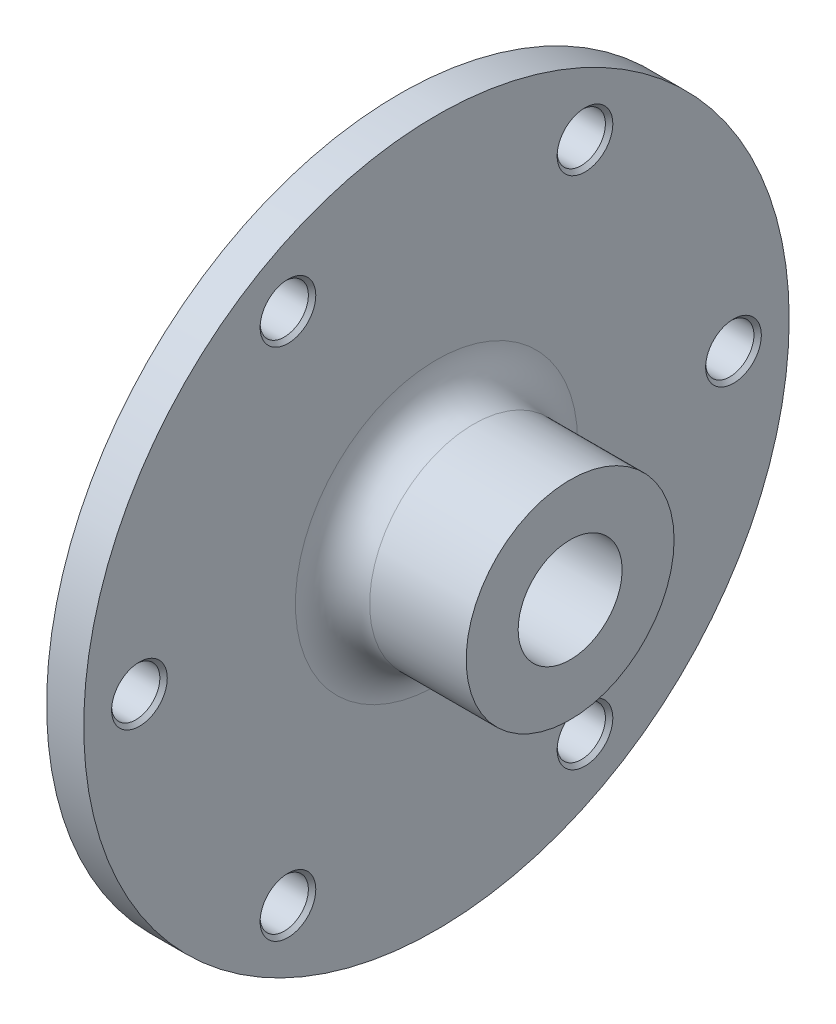
ISO-10303-21;
HEADER;
FILE_DESCRIPTION(('STEP AP214'),'2;1');
FILE_NAME('part.step','',(''),(''),'','','');
FILE_SCHEMA(('AUTOMOTIVE_DESIGN { 1 0 10303 214 1 1 1 1 }'));
ENDSEC;
DATA;
#1=APPLICATION_CONTEXT('core data for automotive mechanical design processes');
#2=APPLICATION_PROTOCOL_DEFINITION('international standard','automotive_design',2000,#1);
#3=PRODUCT_CONTEXT('',#1,'mechanical');
#4=PRODUCT('Part','Part','',(#3));
#5=PRODUCT_RELATED_PRODUCT_CATEGORY('part','',(#4));
#6=PRODUCT_DEFINITION_FORMATION('','',#4);
#7=PRODUCT_DEFINITION_CONTEXT('part definition',#1,'design');
#8=PRODUCT_DEFINITION('design','',#6,#7);
#9=PRODUCT_DEFINITION_SHAPE('','',#8);
#10=(LENGTH_UNIT() NAMED_UNIT(*) SI_UNIT(.MILLI.,.METRE.));
#11=(NAMED_UNIT(*) PLANE_ANGLE_UNIT() SI_UNIT($,.RADIAN.));
#12=(NAMED_UNIT(*) SI_UNIT($,.STERADIAN.) SOLID_ANGLE_UNIT());
#13=UNCERTAINTY_MEASURE_WITH_UNIT(LENGTH_MEASURE(1.E-05),#10,'distance_accuracy_value','');
#14=(GEOMETRIC_REPRESENTATION_CONTEXT(3) GLOBAL_UNCERTAINTY_ASSIGNED_CONTEXT((#13)) GLOBAL_UNIT_ASSIGNED_CONTEXT((#10,
#11,#12)) REPRESENTATION_CONTEXT('',''));
#15=CARTESIAN_POINT('',(0.,0.,0.));
#16=DIRECTION('',(0.,0.,1.));
#17=DIRECTION('',(1.,0.,0.));
#18=AXIS2_PLACEMENT_3D('',#15,#16,#17);
#19=CARTESIAN_POINT('',(0.,14.,0.));
#20=DIRECTION('',(1.,0.,0.));
#21=DIRECTION('',(0.,0.,-1.));
#22=AXIS2_PLACEMENT_3D('',#19,#20,#21);
#23=PLANE('',#22);
#24=CARTESIAN_POINT('',(0.,0.,0.));
#25=DIRECTION('',(-1.,0.,0.));
#26=DIRECTION('',(0.,0.,1.));
#27=AXIS2_PLACEMENT_3D('',#24,#25,#26);
#28=CIRCLE('',#27,6.99999999999999);
#29=CARTESIAN_POINT('',(0.,0.,6.99999999999999));
#30=VERTEX_POINT('',#29);
#31=EDGE_CURVE('E109',#30,#30,#28,.T.);
#32=ORIENTED_EDGE('',*,*,#31,.T.);
#33=EDGE_LOOP('',(#32));
#34=FACE_BOUND('',#33,.T.);
#35=CARTESIAN_POINT('',(0.,0.,0.));
#36=DIRECTION('',(1.,0.,0.));
#37=DIRECTION('',(0.,0.,-1.));
#38=AXIS2_PLACEMENT_3D('',#35,#36,#37);
#39=CIRCLE('',#38,14.);
#40=CARTESIAN_POINT('',(0.,0.,-14.));
#41=VERTEX_POINT('',#40);
#42=EDGE_CURVE('E112',#41,#41,#39,.T.);
#43=ORIENTED_EDGE('',*,*,#42,.T.);
#44=EDGE_LOOP('',(#43));
#45=FACE_BOUND('',#44,.T.);
#46=ADVANCED_FACE('F37',(#34,#45),#23,.T.);
#47=CARTESIAN_POINT('',(-28.,0.,0.));
#48=DIRECTION('',(-1.,0.,0.));
#49=DIRECTION('',(0.,0.,1.));
#50=AXIS2_PLACEMENT_3D('',#47,#48,#49);
#51=PLANE('',#50);
#52=CARTESIAN_POINT('',(-28.,0.,0.));
#53=DIRECTION('',(-1.,0.,0.));
#54=DIRECTION('',(0.,0.,1.));
#55=AXIS2_PLACEMENT_3D('',#52,#53,#54);
#56=CIRCLE('',#55,13.);
#57=CARTESIAN_POINT('',(-28.,0.,13.));
#58=VERTEX_POINT('',#57);
#59=EDGE_CURVE('E57',#58,#58,#56,.T.);
#60=ORIENTED_EDGE('',*,*,#59,.F.);
#61=EDGE_LOOP('',(#60));
#62=FACE_BOUND('',#61,.T.);
#63=CARTESIAN_POINT('',(-28.,0.,0.));
#64=DIRECTION('',(1.,0.,0.));
#65=DIRECTION('',(0.,0.,-1.));
#66=AXIS2_PLACEMENT_3D('',#63,#64,#65);
#67=CIRCLE('',#66,35.);
#68=CARTESIAN_POINT('',(-28.,0.,-35.));
#69=VERTEX_POINT('',#68);
#70=EDGE_CURVE('E50',#69,#69,#67,.T.);
#71=ORIENTED_EDGE('',*,*,#70,.F.);
#72=EDGE_LOOP('',(#71));
#73=FACE_BOUND('',#72,.T.);
#74=ADVANCED_FACE('F129',(#62,#73),#51,.T.);
#75=CARTESIAN_POINT('',(0.,0.,0.));
#76=DIRECTION('',(1.,0.,0.));
#77=DIRECTION('',(0.,0.,-1.));
#78=AXIS2_PLACEMENT_3D('',#75,#76,#77);
#79=CYLINDRICAL_SURFACE('',#78,35.);
#80=ORIENTED_EDGE('',*,*,#70,.T.);
#81=EDGE_LOOP('',(#80));
#82=FACE_BOUND('',#81,.T.);
#83=CARTESIAN_POINT('',(-23.,0.,0.));
#84=DIRECTION('',(1.,0.,0.));
#85=DIRECTION('',(0.,0.,-1.));
#86=AXIS2_PLACEMENT_3D('',#83,#84,#85);
#87=CIRCLE('',#86,35.);
#88=CARTESIAN_POINT('',(-23.,0.,-35.));
#89=VERTEX_POINT('',#88);
#90=EDGE_CURVE('E121',#89,#89,#87,.T.);
#91=ORIENTED_EDGE('',*,*,#90,.F.);
#92=EDGE_LOOP('',(#91));
#93=FACE_BOUND('',#92,.T.);
#94=ADVANCED_FACE('F126',(#82,#93),#79,.T.);
#95=CARTESIAN_POINT('',(-23.,35.,0.));
#96=DIRECTION('',(-1.,0.,0.));
#97=DIRECTION('',(0.,0.,1.));
#98=AXIS2_PLACEMENT_3D('',#95,#96,#97);
#99=PLANE('',#98);
#100=CARTESIAN_POINT('',(-23.,34.6410161513773,20.0000000000004));
#101=DIRECTION('',(-1.,0.,0.));
#102=DIRECTION('',(0.,0.,1.));
#103=AXIS2_PLACEMENT_3D('',#100,#101,#102);
#104=CIRCLE('',#103,3.25);
#105=CARTESIAN_POINT('',(-23.,34.6410161513773,23.2500000000004));
#106=VERTEX_POINT('',#105);
#107=EDGE_CURVE('E41',#106,#106,#104,.T.);
#108=ORIENTED_EDGE('',*,*,#107,.F.);
#109=EDGE_LOOP('',(#108));
#110=FACE_BOUND('',#109,.T.);
#111=CARTESIAN_POINT('',(-23.,34.6410161513777,-19.9999999999997));
#112=DIRECTION('',(-1.,0.,0.));
#113=DIRECTION('',(0.,0.,1.));
#114=AXIS2_PLACEMENT_3D('',#111,#112,#113);
#115=CIRCLE('',#114,3.25);
#116=CARTESIAN_POINT('',(-23.,34.6410161513777,-16.7499999999997));
#117=VERTEX_POINT('',#116);
#118=EDGE_CURVE('E73',#117,#117,#115,.T.);
#119=ORIENTED_EDGE('',*,*,#118,.F.);
#120=EDGE_LOOP('',(#119));
#121=FACE_BOUND('',#120,.T.);
#122=CARTESIAN_POINT('',(-23.,0.,-40.));
#123=DIRECTION('',(-1.,0.,0.));
#124=DIRECTION('',(0.,0.,1.));
#125=AXIS2_PLACEMENT_3D('',#122,#123,#124);
#126=CIRCLE('',#125,3.25);
#127=CARTESIAN_POINT('',(-23.,0.,-36.75));
#128=VERTEX_POINT('',#127);
#129=EDGE_CURVE('E69',#128,#128,#126,.T.);
#130=ORIENTED_EDGE('',*,*,#129,.F.);
#131=EDGE_LOOP('',(#130));
#132=FACE_BOUND('',#131,.T.);
#133=CARTESIAN_POINT('',(-23.,-34.6410161513775,-20.0000000000002));
#134=DIRECTION('',(-1.,0.,0.));
#135=DIRECTION('',(0.,0.,1.));
#136=AXIS2_PLACEMENT_3D('',#133,#134,#135);
#137=CIRCLE('',#136,3.25);
#138=CARTESIAN_POINT('',(-23.,-34.6410161513775,-16.7500000000002));
#139=VERTEX_POINT('',#138);
#140=EDGE_CURVE('E64',#139,#139,#137,.T.);
#141=ORIENTED_EDGE('',*,*,#140,.F.);
#142=EDGE_LOOP('',(#141));
#143=FACE_BOUND('',#142,.T.);
#144=CARTESIAN_POINT('',(-23.,-34.6410161513776,19.9999999999999));
#145=DIRECTION('',(-1.,0.,0.));
#146=DIRECTION('',(0.,0.,1.));
#147=AXIS2_PLACEMENT_3D('',#144,#145,#146);
#148=CIRCLE('',#147,3.25);
#149=CARTESIAN_POINT('',(-23.,-34.6410161513776,23.2499999999999));
#150=VERTEX_POINT('',#149);
#151=EDGE_CURVE('E59',#150,#150,#148,.T.);
#152=ORIENTED_EDGE('',*,*,#151,.F.);
#153=EDGE_LOOP('',(#152));
#154=FACE_BOUND('',#153,.T.);
#155=CARTESIAN_POINT('',(-23.,0.,40.));
#156=DIRECTION('',(-1.,0.,0.));
#157=DIRECTION('',(0.,0.,1.));
#158=AXIS2_PLACEMENT_3D('',#155,#156,#157);
#159=CIRCLE('',#158,3.25);
#160=CARTESIAN_POINT('',(-23.,0.,43.25));
#161=VERTEX_POINT('',#160);
#162=EDGE_CURVE('E54',#161,#161,#159,.T.);
#163=ORIENTED_EDGE('',*,*,#162,.F.);
#164=EDGE_LOOP('',(#163));
#165=FACE_BOUND('',#164,.T.);
#166=ORIENTED_EDGE('',*,*,#90,.T.);
#167=EDGE_LOOP('',(#166));
#168=FACE_BOUND('',#167,.T.);
#169=CARTESIAN_POINT('',(-23.,0.,0.));
#170=DIRECTION('',(1.,0.,0.));
#171=DIRECTION('',(0.,0.,-1.));
#172=AXIS2_PLACEMENT_3D('',#169,#170,#171);
#173=CIRCLE('',#172,47.5);
#174=CARTESIAN_POINT('',(-23.,0.,-47.5));
#175=VERTEX_POINT('',#174);
#176=EDGE_CURVE('E118',#175,#175,#173,.T.);
#177=ORIENTED_EDGE('',*,*,#176,.F.);
#178=EDGE_LOOP('',(#177));
#179=FACE_BOUND('',#178,.T.);
#180=ADVANCED_FACE('F137',(#110,#121,#132,#143,#154,#165,#168,#179),#99,.T.);
#181=CARTESIAN_POINT('',(0.,0.,0.));
#182=DIRECTION('',(1.,0.,0.));
#183=DIRECTION('',(0.,0.,-1.));
#184=AXIS2_PLACEMENT_3D('',#181,#182,#183);
#185=CYLINDRICAL_SURFACE('',#184,47.5);
#186=ORIENTED_EDGE('',*,*,#176,.T.);
#187=EDGE_LOOP('',(#186));
#188=FACE_BOUND('',#187,.T.);
#189=CARTESIAN_POINT('',(-18.,0.,0.));
#190=DIRECTION('',(1.,0.,0.));
#191=DIRECTION('',(0.,0.,-1.));
#192=AXIS2_PLACEMENT_3D('',#189,#190,#191);
#193=CIRCLE('',#192,47.5);
#194=CARTESIAN_POINT('',(-18.,0.,-47.5));
#195=VERTEX_POINT('',#194);
#196=EDGE_CURVE('E115',#195,#195,#193,.T.);
#197=ORIENTED_EDGE('',*,*,#196,.F.);
#198=EDGE_LOOP('',(#197));
#199=FACE_BOUND('',#198,.T.);
#200=ADVANCED_FACE('F144',(#188,#199),#185,.T.);
#201=CARTESIAN_POINT('',(-18.,47.5,0.));
#202=DIRECTION('',(1.,0.,0.));
#203=DIRECTION('',(0.,0.,-1.));
#204=AXIS2_PLACEMENT_3D('',#201,#202,#203);
#205=PLANE('',#204);
#206=CARTESIAN_POINT('',(-18.,34.6410161513773,20.0000000000004));
#207=DIRECTION('',(1.,0.,0.));
#208=DIRECTION('',(0.,0.,-1.));
#209=AXIS2_PLACEMENT_3D('',#206,#207,#208);
#210=CIRCLE('',#209,3.75);
#211=CARTESIAN_POINT('',(-18.,34.6410161513773,16.2500000000004));
#212=VERTEX_POINT('',#211);
#213=EDGE_CURVE('E219',#212,#212,#210,.T.);
#214=ORIENTED_EDGE('',*,*,#213,.F.);
#215=EDGE_LOOP('',(#214));
#216=FACE_BOUND('',#215,.T.);
#217=CARTESIAN_POINT('',(-18.,34.6410161513777,-19.9999999999997));
#218=DIRECTION('',(1.,0.,0.));
#219=DIRECTION('',(0.,0.,-1.));
#220=AXIS2_PLACEMENT_3D('',#217,#218,#219);
#221=CIRCLE('',#220,3.75);
#222=CARTESIAN_POINT('',(-18.,34.6410161513777,-23.7499999999997));
#223=VERTEX_POINT('',#222);
#224=EDGE_CURVE('E82',#223,#223,#221,.T.);
#225=ORIENTED_EDGE('',*,*,#224,.F.);
#226=EDGE_LOOP('',(#225));
#227=FACE_BOUND('',#226,.T.);
#228=CARTESIAN_POINT('',(-18.,0.,-40.));
#229=DIRECTION('',(1.,0.,0.));
#230=DIRECTION('',(0.,0.,-1.));
#231=AXIS2_PLACEMENT_3D('',#228,#229,#230);
#232=CIRCLE('',#231,3.75);
#233=CARTESIAN_POINT('',(-18.,0.,-43.75));
#234=VERTEX_POINT('',#233);
#235=EDGE_CURVE('E75',#234,#234,#232,.T.);
#236=ORIENTED_EDGE('',*,*,#235,.F.);
#237=EDGE_LOOP('',(#236));
#238=FACE_BOUND('',#237,.T.);
#239=CARTESIAN_POINT('',(-18.,-34.6410161513775,-20.0000000000002));
#240=DIRECTION('',(1.,0.,0.));
#241=DIRECTION('',(0.,0.,-1.));
#242=AXIS2_PLACEMENT_3D('',#239,#240,#241);
#243=CIRCLE('',#242,3.75);
#244=CARTESIAN_POINT('',(-18.,-34.6410161513775,-23.7500000000002));
#245=VERTEX_POINT('',#244);
#246=EDGE_CURVE('E71',#245,#245,#243,.T.);
#247=ORIENTED_EDGE('',*,*,#246,.F.);
#248=EDGE_LOOP('',(#247));
#249=FACE_BOUND('',#248,.T.);
#250=CARTESIAN_POINT('',(-18.,-34.6410161513776,19.9999999999999));
#251=DIRECTION('',(1.,0.,0.));
#252=DIRECTION('',(0.,0.,-1.));
#253=AXIS2_PLACEMENT_3D('',#250,#251,#252);
#254=CIRCLE('',#253,3.75);
#255=CARTESIAN_POINT('',(-18.,-34.6410161513776,16.2499999999999));
#256=VERTEX_POINT('',#255);
#257=EDGE_CURVE('E67',#256,#256,#254,.T.);
#258=ORIENTED_EDGE('',*,*,#257,.F.);
#259=EDGE_LOOP('',(#258));
#260=FACE_BOUND('',#259,.T.);
#261=CARTESIAN_POINT('',(-18.,0.,40.));
#262=DIRECTION('',(1.,0.,0.));
#263=DIRECTION('',(0.,0.,-1.));
#264=AXIS2_PLACEMENT_3D('',#261,#262,#263);
#265=CIRCLE('',#264,3.75);
#266=CARTESIAN_POINT('',(-18.,0.,36.25));
#267=VERTEX_POINT('',#266);
#268=EDGE_CURVE('E62',#267,#267,#265,.T.);
#269=ORIENTED_EDGE('',*,*,#268,.F.);
#270=EDGE_LOOP('',(#269));
#271=FACE_BOUND('',#270,.T.);
#272=CARTESIAN_POINT('',(-18.,0.,0.));
#273=DIRECTION('',(1.,0.,0.));
#274=DIRECTION('',(0.,0.,-1.));
#275=AXIS2_PLACEMENT_3D('',#272,#273,#274);
#276=CIRCLE('',#275,19.);
#277=CARTESIAN_POINT('',(-18.,0.,-19.));
#278=VERTEX_POINT('',#277);
#279=EDGE_CURVE('E10',#278,#278,#276,.F.);
#280=ORIENTED_EDGE('',*,*,#279,.T.);
#281=EDGE_LOOP('',(#280));
#282=FACE_BOUND('',#281,.T.);
#283=ORIENTED_EDGE('',*,*,#196,.T.);
#284=EDGE_LOOP('',(#283));
#285=FACE_BOUND('',#284,.T.);
#286=ADVANCED_FACE('F148',(#216,#227,#238,#249,#260,#271,#282,#285),#205,.T.);
#287=CARTESIAN_POINT('',(0.,0.,0.));
#288=DIRECTION('',(1.,0.,0.));
#289=DIRECTION('',(0.,0.,-1.));
#290=AXIS2_PLACEMENT_3D('',#287,#288,#289);
#291=CYLINDRICAL_SURFACE('',#290,14.);
#292=CARTESIAN_POINT('',(-13.,0.,0.));
#293=DIRECTION('',(1.,0.,0.));
#294=DIRECTION('',(0.,0.,-1.));
#295=AXIS2_PLACEMENT_3D('',#292,#293,#294);
#296=CIRCLE('',#295,14.);
#297=CARTESIAN_POINT('',(-13.,0.,-14.));
#298=VERTEX_POINT('',#297);
#299=EDGE_CURVE('E45',#298,#298,#296,.T.);
#300=ORIENTED_EDGE('',*,*,#299,.T.);
#301=EDGE_LOOP('',(#300));
#302=FACE_BOUND('',#301,.T.);
#303=ORIENTED_EDGE('',*,*,#42,.F.);
#304=EDGE_LOOP('',(#303));
#305=FACE_BOUND('',#304,.T.);
#306=ADVANCED_FACE('F152',(#302,#305),#291,.T.);
#307=CARTESIAN_POINT('',(-13.,0.,0.));
#308=DIRECTION('',(1.,0.,0.));
#309=DIRECTION('',(0.,0.,-1.));
#310=AXIS2_PLACEMENT_3D('',#307,#308,#309);
#311=TOROIDAL_SURFACE('',#310,19.,5.);
#312=ORIENTED_EDGE('',*,*,#279,.F.);
#313=EDGE_LOOP('',(#312));
#314=FACE_BOUND('',#313,.T.);
#315=ORIENTED_EDGE('',*,*,#299,.F.);
#316=EDGE_LOOP('',(#315));
#317=FACE_BOUND('',#316,.T.);
#318=ADVANCED_FACE('F39',(#314,#317),#311,.F.);
#319=CARTESIAN_POINT('',(-28.,0.,0.));
#320=DIRECTION('',(-1.,0.,0.));
#321=DIRECTION('',(0.,0.,1.));
#322=AXIS2_PLACEMENT_3D('',#319,#320,#321);
#323=CYLINDRICAL_SURFACE('',#322,6.99999999999999);
#324=ORIENTED_EDGE('',*,*,#31,.F.);
#325=EDGE_LOOP('',(#324));
#326=FACE_BOUND('',#325,.T.);
#327=CARTESIAN_POINT('',(-22.,0.,0.));
#328=DIRECTION('',(-1.,0.,0.));
#329=DIRECTION('',(0.,0.,1.));
#330=AXIS2_PLACEMENT_3D('',#327,#328,#329);
#331=CIRCLE('',#330,7.);
#332=CARTESIAN_POINT('',(-22.,0.,7.));
#333=VERTEX_POINT('',#332);
#334=EDGE_CURVE('E106',#333,#333,#331,.T.);
#335=ORIENTED_EDGE('',*,*,#334,.T.);
#336=EDGE_LOOP('',(#335));
#337=FACE_BOUND('',#336,.T.);
#338=ADVANCED_FACE('F157',(#326,#337),#323,.F.);
#339=CARTESIAN_POINT('',(-28.,0.,0.));
#340=DIRECTION('',(-1.,0.,0.));
#341=DIRECTION('',(0.,0.,1.));
#342=AXIS2_PLACEMENT_3D('',#339,#340,#341);
#343=CONICAL_SURFACE('',#342,13.,0.785398163397449);
#344=ORIENTED_EDGE('',*,*,#334,.F.);
#345=EDGE_LOOP('',(#344));
#346=FACE_BOUND('',#345,.T.);
#347=ORIENTED_EDGE('',*,*,#59,.T.);
#348=EDGE_LOOP('',(#347));
#349=FACE_BOUND('',#348,.T.);
#350=ADVANCED_FACE('F160',(#346,#349),#343,.F.);
#351=CARTESIAN_POINT('',(-18.,0.,40.));
#352=DIRECTION('',(1.,0.,0.));
#353=DIRECTION('',(0.,0.,-1.));
#354=AXIS2_PLACEMENT_3D('',#351,#352,#353);
#355=CYLINDRICAL_SURFACE('',#354,3.25);
#356=ORIENTED_EDGE('',*,*,#162,.T.);
#357=EDGE_LOOP('',(#356));
#358=FACE_BOUND('',#357,.T.);
#359=CARTESIAN_POINT('',(-18.5,0.,40.));
#360=DIRECTION('',(1.,0.,0.));
#361=DIRECTION('',(0.,0.,-1.));
#362=AXIS2_PLACEMENT_3D('',#359,#360,#361);
#363=CIRCLE('',#362,3.25);
#364=CARTESIAN_POINT('',(-18.5,0.,36.75));
#365=VERTEX_POINT('',#364);
#366=EDGE_CURVE('E58',#365,#365,#363,.T.);
#367=ORIENTED_EDGE('',*,*,#366,.T.);
#368=EDGE_LOOP('',(#367));
#369=FACE_BOUND('',#368,.T.);
#370=ADVANCED_FACE('F164',(#358,#369),#355,.F.);
#371=CARTESIAN_POINT('',(-18.,0.,40.));
#372=DIRECTION('',(1.,0.,0.));
#373=DIRECTION('',(0.,0.,-1.));
#374=AXIS2_PLACEMENT_3D('',#371,#372,#373);
#375=CONICAL_SURFACE('',#374,3.75,0.785398163397447);
#376=ORIENTED_EDGE('',*,*,#366,.F.);
#377=EDGE_LOOP('',(#376));
#378=FACE_BOUND('',#377,.T.);
#379=ORIENTED_EDGE('',*,*,#268,.T.);
#380=EDGE_LOOP('',(#379));
#381=FACE_BOUND('',#380,.T.);
#382=ADVANCED_FACE('F168',(#378,#381),#375,.F.);
#383=CARTESIAN_POINT('',(-18.,-34.6410161513776,19.9999999999999));
#384=DIRECTION('',(1.,0.,0.));
#385=DIRECTION('',(0.,0.,-1.));
#386=AXIS2_PLACEMENT_3D('',#383,#384,#385);
#387=CYLINDRICAL_SURFACE('',#386,3.25);
#388=ORIENTED_EDGE('',*,*,#151,.T.);
#389=EDGE_LOOP('',(#388));
#390=FACE_BOUND('',#389,.T.);
#391=CARTESIAN_POINT('',(-18.5,-34.6410161513776,19.9999999999999));
#392=DIRECTION('',(1.,0.,0.));
#393=DIRECTION('',(0.,0.,-1.));
#394=AXIS2_PLACEMENT_3D('',#391,#392,#393);
#395=CIRCLE('',#394,3.25);
#396=CARTESIAN_POINT('',(-18.5,-34.6410161513776,16.7499999999999));
#397=VERTEX_POINT('',#396);
#398=EDGE_CURVE('E63',#397,#397,#395,.T.);
#399=ORIENTED_EDGE('',*,*,#398,.T.);
#400=EDGE_LOOP('',(#399));
#401=FACE_BOUND('',#400,.T.);
#402=ADVANCED_FACE('F172',(#390,#401),#387,.F.);
#403=CARTESIAN_POINT('',(-18.,-34.6410161513776,19.9999999999999));
#404=DIRECTION('',(1.,0.,0.));
#405=DIRECTION('',(0.,0.,-1.));
#406=AXIS2_PLACEMENT_3D('',#403,#404,#405);
#407=CONICAL_SURFACE('',#406,3.75,0.785398163397448);
#408=ORIENTED_EDGE('',*,*,#398,.F.);
#409=EDGE_LOOP('',(#408));
#410=FACE_BOUND('',#409,.T.);
#411=ORIENTED_EDGE('',*,*,#257,.T.);
#412=EDGE_LOOP('',(#411));
#413=FACE_BOUND('',#412,.T.);
#414=ADVANCED_FACE('F176',(#410,#413),#407,.F.);
#415=CARTESIAN_POINT('',(-18.,-34.6410161513775,-20.0000000000002));
#416=DIRECTION('',(1.,0.,0.));
#417=DIRECTION('',(0.,0.,-1.));
#418=AXIS2_PLACEMENT_3D('',#415,#416,#417);
#419=CYLINDRICAL_SURFACE('',#418,3.25);
#420=ORIENTED_EDGE('',*,*,#140,.T.);
#421=EDGE_LOOP('',(#420));
#422=FACE_BOUND('',#421,.T.);
#423=CARTESIAN_POINT('',(-18.5,-34.6410161513775,-20.0000000000002));
#424=DIRECTION('',(1.,0.,0.));
#425=DIRECTION('',(0.,0.,-1.));
#426=AXIS2_PLACEMENT_3D('',#423,#424,#425);
#427=CIRCLE('',#426,3.25);
#428=CARTESIAN_POINT('',(-18.5,-34.6410161513775,-23.2500000000002));
#429=VERTEX_POINT('',#428);
#430=EDGE_CURVE('E68',#429,#429,#427,.T.);
#431=ORIENTED_EDGE('',*,*,#430,.T.);
#432=EDGE_LOOP('',(#431));
#433=FACE_BOUND('',#432,.T.);
#434=ADVANCED_FACE('F180',(#422,#433),#419,.F.);
#435=CARTESIAN_POINT('',(-18.,-34.6410161513775,-20.0000000000002));
#436=DIRECTION('',(1.,0.,0.));
#437=DIRECTION('',(0.,0.,-1.));
#438=AXIS2_PLACEMENT_3D('',#435,#436,#437);
#439=CONICAL_SURFACE('',#438,3.75,0.785398163397448);
#440=ORIENTED_EDGE('',*,*,#430,.F.);
#441=EDGE_LOOP('',(#440));
#442=FACE_BOUND('',#441,.T.);
#443=ORIENTED_EDGE('',*,*,#246,.T.);
#444=EDGE_LOOP('',(#443));
#445=FACE_BOUND('',#444,.T.);
#446=ADVANCED_FACE('F184',(#442,#445),#439,.F.);
#447=CARTESIAN_POINT('',(-18.,0.,-40.));
#448=DIRECTION('',(1.,0.,0.));
#449=DIRECTION('',(0.,0.,-1.));
#450=AXIS2_PLACEMENT_3D('',#447,#448,#449);
#451=CYLINDRICAL_SURFACE('',#450,3.25);
#452=ORIENTED_EDGE('',*,*,#129,.T.);
#453=EDGE_LOOP('',(#452));
#454=FACE_BOUND('',#453,.T.);
#455=CARTESIAN_POINT('',(-18.5,0.,-40.));
#456=DIRECTION('',(1.,0.,0.));
#457=DIRECTION('',(0.,0.,-1.));
#458=AXIS2_PLACEMENT_3D('',#455,#456,#457);
#459=CIRCLE('',#458,3.25);
#460=CARTESIAN_POINT('',(-18.5,0.,-43.25));
#461=VERTEX_POINT('',#460);
#462=EDGE_CURVE('E72',#461,#461,#459,.T.);
#463=ORIENTED_EDGE('',*,*,#462,.T.);
#464=EDGE_LOOP('',(#463));
#465=FACE_BOUND('',#464,.T.);
#466=ADVANCED_FACE('F188',(#454,#465),#451,.F.);
#467=CARTESIAN_POINT('',(-18.,0.,-40.));
#468=DIRECTION('',(1.,0.,0.));
#469=DIRECTION('',(0.,0.,-1.));
#470=AXIS2_PLACEMENT_3D('',#467,#468,#469);
#471=CONICAL_SURFACE('',#470,3.75,0.785398163397447);
#472=ORIENTED_EDGE('',*,*,#462,.F.);
#473=EDGE_LOOP('',(#472));
#474=FACE_BOUND('',#473,.T.);
#475=ORIENTED_EDGE('',*,*,#235,.T.);
#476=EDGE_LOOP('',(#475));
#477=FACE_BOUND('',#476,.T.);
#478=ADVANCED_FACE('F192',(#474,#477),#471,.F.);
#479=CARTESIAN_POINT('',(-18.,34.6410161513777,-19.9999999999997));
#480=DIRECTION('',(1.,0.,0.));
#481=DIRECTION('',(0.,0.,-1.));
#482=AXIS2_PLACEMENT_3D('',#479,#480,#481);
#483=CYLINDRICAL_SURFACE('',#482,3.25);
#484=ORIENTED_EDGE('',*,*,#118,.T.);
#485=EDGE_LOOP('',(#484));
#486=FACE_BOUND('',#485,.T.);
#487=CARTESIAN_POINT('',(-18.5,34.6410161513777,-19.9999999999997));
#488=DIRECTION('',(1.,0.,0.));
#489=DIRECTION('',(0.,0.,-1.));
#490=AXIS2_PLACEMENT_3D('',#487,#488,#489);
#491=CIRCLE('',#490,3.25);
#492=CARTESIAN_POINT('',(-18.5,34.6410161513777,-23.2499999999997));
#493=VERTEX_POINT('',#492);
#494=EDGE_CURVE('E76',#493,#493,#491,.T.);
#495=ORIENTED_EDGE('',*,*,#494,.T.);
#496=EDGE_LOOP('',(#495));
#497=FACE_BOUND('',#496,.T.);
#498=ADVANCED_FACE('F196',(#486,#497),#483,.F.);
#499=CARTESIAN_POINT('',(-18.,34.6410161513777,-19.9999999999997));
#500=DIRECTION('',(1.,0.,0.));
#501=DIRECTION('',(0.,0.,-1.));
#502=AXIS2_PLACEMENT_3D('',#499,#500,#501);
#503=CONICAL_SURFACE('',#502,3.75,0.785398163397445);
#504=ORIENTED_EDGE('',*,*,#494,.F.);
#505=EDGE_LOOP('',(#504));
#506=FACE_BOUND('',#505,.T.);
#507=ORIENTED_EDGE('',*,*,#224,.T.);
#508=EDGE_LOOP('',(#507));
#509=FACE_BOUND('',#508,.T.);
#510=ADVANCED_FACE('F200',(#506,#509),#503,.F.);
#511=CARTESIAN_POINT('',(-18.,34.6410161513773,20.0000000000004));
#512=DIRECTION('',(1.,0.,0.));
#513=DIRECTION('',(0.,0.,-1.));
#514=AXIS2_PLACEMENT_3D('',#511,#512,#513);
#515=CYLINDRICAL_SURFACE('',#514,3.25);
#516=ORIENTED_EDGE('',*,*,#107,.T.);
#517=EDGE_LOOP('',(#516));
#518=FACE_BOUND('',#517,.T.);
#519=CARTESIAN_POINT('',(-18.5,34.6410161513773,20.0000000000004));
#520=DIRECTION('',(1.,0.,0.));
#521=DIRECTION('',(0.,0.,-1.));
#522=AXIS2_PLACEMENT_3D('',#519,#520,#521);
#523=CIRCLE('',#522,3.25);
#524=CARTESIAN_POINT('',(-18.5,34.6410161513773,16.7500000000004));
#525=VERTEX_POINT('',#524);
#526=EDGE_CURVE('E216',#525,#525,#523,.T.);
#527=ORIENTED_EDGE('',*,*,#526,.T.);
#528=EDGE_LOOP('',(#527));
#529=FACE_BOUND('',#528,.T.);
#530=ADVANCED_FACE('F203',(#518,#529),#515,.F.);
#531=CARTESIAN_POINT('',(-18.,34.6410161513773,20.0000000000004));
#532=DIRECTION('',(1.,0.,0.));
#533=DIRECTION('',(0.,0.,-1.));
#534=AXIS2_PLACEMENT_3D('',#531,#532,#533);
#535=CONICAL_SURFACE('',#534,3.75,0.785398163397445);
#536=ORIENTED_EDGE('',*,*,#526,.F.);
#537=EDGE_LOOP('',(#536));
#538=FACE_BOUND('',#537,.T.);
#539=ORIENTED_EDGE('',*,*,#213,.T.);
#540=EDGE_LOOP('',(#539));
#541=FACE_BOUND('',#540,.T.);
#542=ADVANCED_FACE('F207',(#538,#541),#535,.F.);
#543=CLOSED_SHELL('',(#46,#74,#94,#180,#200,#286,#306,#318,#338,#350,#370,#382,#402,#414,#434,
#446,#466,#478,#498,#510,#530,#542));
#544=MANIFOLD_SOLID_BREP('B2',#543);
#545=ADVANCED_BREP_SHAPE_REPRESENTATION('',(#18,#544),#14);
#546=SHAPE_DEFINITION_REPRESENTATION(#9,#545);
ENDSEC;
END-ISO-10303-21;
